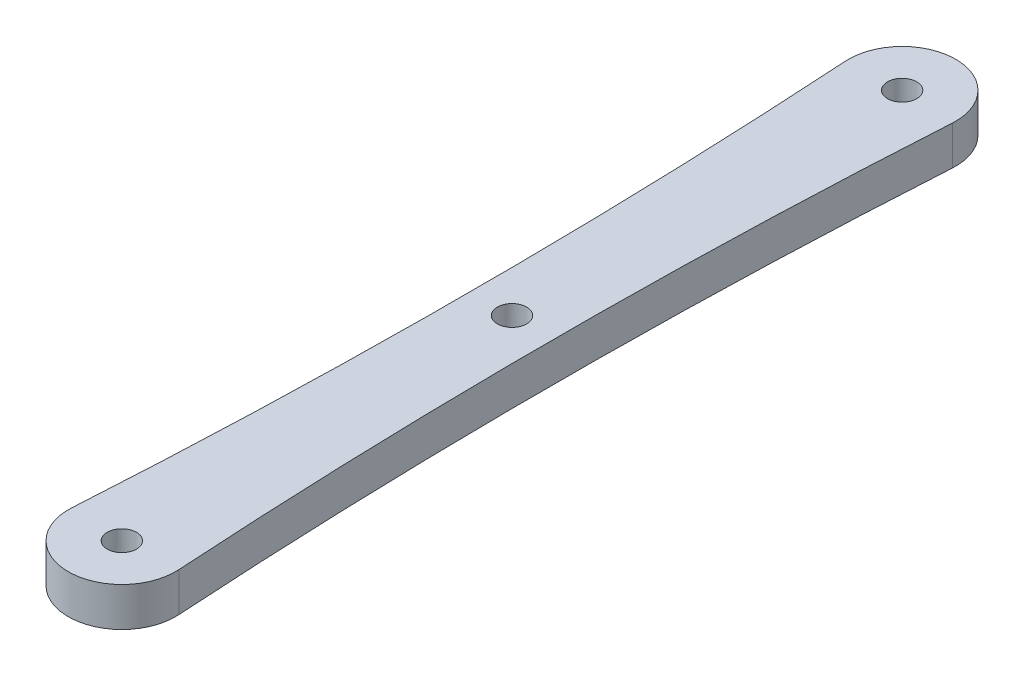
ISO-10303-21;
HEADER;
FILE_DESCRIPTION(('STEP AP214'),'2;1');
FILE_NAME('part.step','',(''),(''),'','','');
FILE_SCHEMA(('AUTOMOTIVE_DESIGN { 1 0 10303 214 1 1 1 1 }'));
ENDSEC;
DATA;
#1=APPLICATION_CONTEXT('core data for automotive mechanical design processes');
#2=APPLICATION_PROTOCOL_DEFINITION('international standard','automotive_design',2000,#1);
#3=PRODUCT_CONTEXT('',#1,'mechanical');
#4=PRODUCT('Part','Part','',(#3));
#5=PRODUCT_RELATED_PRODUCT_CATEGORY('part','',(#4));
#6=PRODUCT_DEFINITION_FORMATION('','',#4);
#7=PRODUCT_DEFINITION_CONTEXT('part definition',#1,'design');
#8=PRODUCT_DEFINITION('design','',#6,#7);
#9=PRODUCT_DEFINITION_SHAPE('','',#8);
#10=(LENGTH_UNIT() NAMED_UNIT(*) SI_UNIT(.MILLI.,.METRE.));
#11=(NAMED_UNIT(*) PLANE_ANGLE_UNIT() SI_UNIT($,.RADIAN.));
#12=(NAMED_UNIT(*) SI_UNIT($,.STERADIAN.) SOLID_ANGLE_UNIT());
#13=UNCERTAINTY_MEASURE_WITH_UNIT(LENGTH_MEASURE(1.E-05),#10,'distance_accuracy_value','');
#14=(GEOMETRIC_REPRESENTATION_CONTEXT(3) GLOBAL_UNCERTAINTY_ASSIGNED_CONTEXT((#13)) GLOBAL_UNIT_ASSIGNED_CONTEXT((#10,
#11,#12)) REPRESENTATION_CONTEXT('',''));
#15=CARTESIAN_POINT('',(0.,0.,0.));
#16=DIRECTION('',(0.,0.,1.));
#17=DIRECTION('',(1.,0.,0.));
#18=AXIS2_PLACEMENT_3D('',#15,#16,#17);
#19=CARTESIAN_POINT('',(-319.6875,4.,-19.9999999999999));
#20=DIRECTION('',(0.,-1.,0.));
#21=DIRECTION('',(0.,0.,-1.));
#22=AXIS2_PLACEMENT_3D('',#19,#20,#21);
#23=PLANE('',#22);
#24=CARTESIAN_POINT('',(-639.375,4.,-39.9999999999998));
#25=DIRECTION('',(0.,-1.,0.));
#26=DIRECTION('',(0.,0.,-1.));
#27=AXIS2_PLACEMENT_3D('',#24,#25,#26);
#28=CIRCLE('',#27,635.124999999999);
#29=CARTESIAN_POINT('',(-5.48926829268328,4.,-79.6565853658536));
#30=VERTEX_POINT('',#29);
#31=CARTESIAN_POINT('',(-5.48926829268329,4.,-0.343414634146373));
#32=VERTEX_POINT('',#31);
#33=EDGE_CURVE('E87',#30,#32,#28,.T.);
#34=ORIENTED_EDGE('',*,*,#33,.T.);
#35=CARTESIAN_POINT('',(0.,4.,0.));
#36=DIRECTION('',(0.,1.,0.));
#37=DIRECTION('',(0.,0.,1.));
#38=AXIS2_PLACEMENT_3D('',#35,#36,#37);
#39=CIRCLE('',#38,5.50000000000036);
#40=CARTESIAN_POINT('',(5.48926829268326,4.,-0.343414634146465));
#41=VERTEX_POINT('',#40);
#42=EDGE_CURVE('E82',#32,#41,#39,.T.);
#43=ORIENTED_EDGE('',*,*,#42,.T.);
#44=CARTESIAN_POINT('',(639.375,4.,-39.9999999999998));
#45=DIRECTION('',(0.,-1.,0.));
#46=DIRECTION('',(0.,0.,1.));
#47=AXIS2_PLACEMENT_3D('',#44,#45,#46);
#48=CIRCLE('',#47,635.124999999999);
#49=CARTESIAN_POINT('',(5.48926829268325,4.,-79.6565853658536));
#50=VERTEX_POINT('',#49);
#51=EDGE_CURVE('E85',#41,#50,#48,.T.);
#52=ORIENTED_EDGE('',*,*,#51,.T.);
#53=CARTESIAN_POINT('',(0.,4.,-80.));
#54=DIRECTION('',(0.,1.,0.));
#55=DIRECTION('',(0.,0.,1.));
#56=AXIS2_PLACEMENT_3D('',#53,#54,#55);
#57=CIRCLE('',#56,5.50000000000034);
#58=EDGE_CURVE('E52',#50,#30,#57,.T.);
#59=ORIENTED_EDGE('',*,*,#58,.T.);
#60=EDGE_LOOP('',(#34,#43,#52,#59));
#61=FACE_BOUND('',#60,.T.);
#62=CARTESIAN_POINT('',(0.,4.,-40.));
#63=DIRECTION('',(0.,1.,0.));
#64=DIRECTION('',(0.,0.,1.));
#65=AXIS2_PLACEMENT_3D('',#62,#63,#64);
#66=CIRCLE('',#65,1.5);
#67=CARTESIAN_POINT('',(0.,4.,-38.5));
#68=VERTEX_POINT('',#67);
#69=EDGE_CURVE('E102',#68,#68,#66,.T.);
#70=ORIENTED_EDGE('',*,*,#69,.F.);
#71=EDGE_LOOP('',(#70));
#72=FACE_BOUND('',#71,.T.);
#73=CARTESIAN_POINT('',(0.,4.,0.));
#74=DIRECTION('',(0.,1.,0.));
#75=DIRECTION('',(0.,0.,1.));
#76=AXIS2_PLACEMENT_3D('',#73,#74,#75);
#77=CIRCLE('',#76,1.5);
#78=CARTESIAN_POINT('',(0.,4.,1.5));
#79=VERTEX_POINT('',#78);
#80=EDGE_CURVE('E117',#79,#79,#77,.T.);
#81=ORIENTED_EDGE('',*,*,#80,.F.);
#82=EDGE_LOOP('',(#81));
#83=FACE_BOUND('',#82,.T.);
#84=CARTESIAN_POINT('',(0.,4.,-80.));
#85=DIRECTION('',(0.,1.,0.));
#86=DIRECTION('',(0.,0.,1.));
#87=AXIS2_PLACEMENT_3D('',#84,#85,#86);
#88=CIRCLE('',#87,1.5);
#89=CARTESIAN_POINT('',(0.,4.,-78.5));
#90=VERTEX_POINT('',#89);
#91=EDGE_CURVE('E123',#90,#90,#88,.T.);
#92=ORIENTED_EDGE('',*,*,#91,.F.);
#93=EDGE_LOOP('',(#92));
#94=FACE_BOUND('',#93,.T.);
#95=ADVANCED_FACE('F35',(#61,#72,#83,#94),#23,.F.);
#96=CARTESIAN_POINT('',(-319.6875,0.,-19.9999999999999));
#97=DIRECTION('',(0.,-1.,0.));
#98=DIRECTION('',(0.,0.,-1.));
#99=AXIS2_PLACEMENT_3D('',#96,#97,#98);
#100=PLANE('',#99);
#101=CARTESIAN_POINT('',(0.,0.,0.));
#102=DIRECTION('',(0.,1.,0.));
#103=DIRECTION('',(0.,0.,1.));
#104=AXIS2_PLACEMENT_3D('',#101,#102,#103);
#105=CIRCLE('',#104,1.5);
#106=CARTESIAN_POINT('',(0.,0.,1.5));
#107=VERTEX_POINT('',#106);
#108=EDGE_CURVE('E120',#107,#107,#105,.T.);
#109=ORIENTED_EDGE('',*,*,#108,.T.);
#110=EDGE_LOOP('',(#109));
#111=FACE_BOUND('',#110,.T.);
#112=CARTESIAN_POINT('',(-639.375,0.,-39.9999999999998));
#113=DIRECTION('',(0.,-1.,0.));
#114=DIRECTION('',(0.,0.,-1.));
#115=AXIS2_PLACEMENT_3D('',#112,#113,#114);
#116=CIRCLE('',#115,635.124999999999);
#117=CARTESIAN_POINT('',(-5.48926829268328,0.,-79.6565853658536));
#118=VERTEX_POINT('',#117);
#119=CARTESIAN_POINT('',(-5.48926829268329,0.,-0.343414634146373));
#120=VERTEX_POINT('',#119);
#121=EDGE_CURVE('E99',#118,#120,#116,.T.);
#122=ORIENTED_EDGE('',*,*,#121,.F.);
#123=CARTESIAN_POINT('',(0.,0.,-80.));
#124=DIRECTION('',(0.,1.,0.));
#125=DIRECTION('',(0.,0.,1.));
#126=AXIS2_PLACEMENT_3D('',#123,#124,#125);
#127=CIRCLE('',#126,5.50000000000034);
#128=CARTESIAN_POINT('',(5.48926829268325,0.,-79.6565853658536));
#129=VERTEX_POINT('',#128);
#130=EDGE_CURVE('E75',#129,#118,#127,.T.);
#131=ORIENTED_EDGE('',*,*,#130,.F.);
#132=CARTESIAN_POINT('',(639.375,0.,-39.9999999999998));
#133=DIRECTION('',(0.,-1.,0.));
#134=DIRECTION('',(0.,0.,1.));
#135=AXIS2_PLACEMENT_3D('',#132,#133,#134);
#136=CIRCLE('',#135,635.124999999999);
#137=CARTESIAN_POINT('',(5.48926829268326,0.,-0.343414634146465));
#138=VERTEX_POINT('',#137);
#139=EDGE_CURVE('E69',#138,#129,#136,.T.);
#140=ORIENTED_EDGE('',*,*,#139,.F.);
#141=CARTESIAN_POINT('',(0.,0.,0.));
#142=DIRECTION('',(0.,1.,0.));
#143=DIRECTION('',(0.,0.,1.));
#144=AXIS2_PLACEMENT_3D('',#141,#142,#143);
#145=CIRCLE('',#144,5.50000000000036);
#146=EDGE_CURVE('E91',#120,#138,#145,.T.);
#147=ORIENTED_EDGE('',*,*,#146,.F.);
#148=EDGE_LOOP('',(#122,#131,#140,#147));
#149=FACE_BOUND('',#148,.T.);
#150=CARTESIAN_POINT('',(0.,0.,-40.));
#151=DIRECTION('',(0.,1.,0.));
#152=DIRECTION('',(0.,0.,1.));
#153=AXIS2_PLACEMENT_3D('',#150,#151,#152);
#154=CIRCLE('',#153,1.5);
#155=CARTESIAN_POINT('',(0.,0.,-38.5));
#156=VERTEX_POINT('',#155);
#157=EDGE_CURVE('E114',#156,#156,#154,.T.);
#158=ORIENTED_EDGE('',*,*,#157,.T.);
#159=EDGE_LOOP('',(#158));
#160=FACE_BOUND('',#159,.T.);
#161=CARTESIAN_POINT('',(0.,0.,-80.));
#162=DIRECTION('',(0.,1.,0.));
#163=DIRECTION('',(0.,0.,1.));
#164=AXIS2_PLACEMENT_3D('',#161,#162,#163);
#165=CIRCLE('',#164,1.5);
#166=CARTESIAN_POINT('',(0.,0.,-78.5));
#167=VERTEX_POINT('',#166);
#168=EDGE_CURVE('E126',#167,#167,#165,.T.);
#169=ORIENTED_EDGE('',*,*,#168,.T.);
#170=EDGE_LOOP('',(#169));
#171=FACE_BOUND('',#170,.T.);
#172=ADVANCED_FACE('F110',(#111,#149,#160,#171),#100,.T.);
#173=CARTESIAN_POINT('',(-639.375,4.,-39.9999999999998));
#174=DIRECTION('',(0.,-1.,0.));
#175=DIRECTION('',(0.,0.,-1.));
#176=AXIS2_PLACEMENT_3D('',#173,#174,#175);
#177=CYLINDRICAL_SURFACE('',#176,635.124999999999);
#178=ORIENTED_EDGE('',*,*,#121,.T.);
#179=DIRECTION('',(0.,-1.,0.));
#180=VECTOR('',#179,1.);
#181=CARTESIAN_POINT('',(-5.48926829268329,4.,-0.343414634146373));
#182=LINE('',#181,#180);
#183=EDGE_CURVE('E11',#32,#120,#182,.T.);
#184=ORIENTED_EDGE('',*,*,#183,.F.);
#185=ORIENTED_EDGE('',*,*,#33,.F.);
#186=DIRECTION('',(0.,-1.,0.));
#187=VECTOR('',#186,1.);
#188=CARTESIAN_POINT('',(-5.48926829268328,4.,-79.6565853658536));
#189=LINE('',#188,#187);
#190=EDGE_CURVE('E95',#30,#118,#189,.T.);
#191=ORIENTED_EDGE('',*,*,#190,.T.);
#192=EDGE_LOOP('',(#178,#184,#185,#191));
#193=FACE_BOUND('',#192,.T.);
#194=ADVANCED_FACE('F37',(#193),#177,.F.);
#195=CARTESIAN_POINT('',(0.,4.,0.));
#196=DIRECTION('',(0.,-1.,0.));
#197=DIRECTION('',(0.,0.,-1.));
#198=AXIS2_PLACEMENT_3D('',#195,#196,#197);
#199=CYLINDRICAL_SURFACE('',#198,5.50000000000036);
#200=ORIENTED_EDGE('',*,*,#146,.T.);
#201=DIRECTION('',(0.,-1.,0.));
#202=VECTOR('',#201,1.);
#203=CARTESIAN_POINT('',(5.48926829268326,4.,-0.343414634146465));
#204=LINE('',#203,#202);
#205=EDGE_CURVE('E44',#41,#138,#204,.T.);
#206=ORIENTED_EDGE('',*,*,#205,.F.);
#207=ORIENTED_EDGE('',*,*,#42,.F.);
#208=ORIENTED_EDGE('',*,*,#183,.T.);
#209=EDGE_LOOP('',(#200,#206,#207,#208));
#210=FACE_BOUND('',#209,.T.);
#211=ADVANCED_FACE('F90',(#210),#199,.T.);
#212=CARTESIAN_POINT('',(639.375,4.,-39.9999999999998));
#213=DIRECTION('',(0.,-1.,0.));
#214=DIRECTION('',(0.,0.,-1.));
#215=AXIS2_PLACEMENT_3D('',#212,#213,#214);
#216=CYLINDRICAL_SURFACE('',#215,635.124999999999);
#217=ORIENTED_EDGE('',*,*,#139,.T.);
#218=DIRECTION('',(0.,-1.,0.));
#219=VECTOR('',#218,1.);
#220=CARTESIAN_POINT('',(5.48926829268325,4.,-79.6565853658536));
#221=LINE('',#220,#219);
#222=EDGE_CURVE('E92',#50,#129,#221,.T.);
#223=ORIENTED_EDGE('',*,*,#222,.F.);
#224=ORIENTED_EDGE('',*,*,#51,.F.);
#225=ORIENTED_EDGE('',*,*,#205,.T.);
#226=EDGE_LOOP('',(#217,#223,#224,#225));
#227=FACE_BOUND('',#226,.T.);
#228=ADVANCED_FACE('F93',(#227),#216,.F.);
#229=CARTESIAN_POINT('',(0.,4.,-80.));
#230=DIRECTION('',(0.,-1.,0.));
#231=DIRECTION('',(0.,0.,-1.));
#232=AXIS2_PLACEMENT_3D('',#229,#230,#231);
#233=CYLINDRICAL_SURFACE('',#232,5.50000000000034);
#234=ORIENTED_EDGE('',*,*,#130,.T.);
#235=ORIENTED_EDGE('',*,*,#190,.F.);
#236=ORIENTED_EDGE('',*,*,#58,.F.);
#237=ORIENTED_EDGE('',*,*,#222,.T.);
#238=EDGE_LOOP('',(#234,#235,#236,#237));
#239=FACE_BOUND('',#238,.T.);
#240=ADVANCED_FACE('F107',(#239),#233,.T.);
#241=CARTESIAN_POINT('',(0.,4.,-40.));
#242=DIRECTION('',(0.,-1.,0.));
#243=DIRECTION('',(0.,0.,-1.));
#244=AXIS2_PLACEMENT_3D('',#241,#242,#243);
#245=CYLINDRICAL_SURFACE('',#244,1.5);
#246=ORIENTED_EDGE('',*,*,#69,.T.);
#247=EDGE_LOOP('',(#246));
#248=FACE_BOUND('',#247,.T.);
#249=ORIENTED_EDGE('',*,*,#157,.F.);
#250=EDGE_LOOP('',(#249));
#251=FACE_BOUND('',#250,.T.);
#252=ADVANCED_FACE('F143',(#248,#251),#245,.F.);
#253=CARTESIAN_POINT('',(0.,4.,0.));
#254=DIRECTION('',(0.,-1.,0.));
#255=DIRECTION('',(0.,0.,-1.));
#256=AXIS2_PLACEMENT_3D('',#253,#254,#255);
#257=CYLINDRICAL_SURFACE('',#256,1.5);
#258=ORIENTED_EDGE('',*,*,#80,.T.);
#259=EDGE_LOOP('',(#258));
#260=FACE_BOUND('',#259,.T.);
#261=ORIENTED_EDGE('',*,*,#108,.F.);
#262=EDGE_LOOP('',(#261));
#263=FACE_BOUND('',#262,.T.);
#264=ADVANCED_FACE('F189',(#260,#263),#257,.F.);
#265=CARTESIAN_POINT('',(0.,4.,-80.));
#266=DIRECTION('',(0.,-1.,0.));
#267=DIRECTION('',(0.,0.,-1.));
#268=AXIS2_PLACEMENT_3D('',#265,#266,#267);
#269=CYLINDRICAL_SURFACE('',#268,1.5);
#270=ORIENTED_EDGE('',*,*,#91,.T.);
#271=EDGE_LOOP('',(#270));
#272=FACE_BOUND('',#271,.T.);
#273=ORIENTED_EDGE('',*,*,#168,.F.);
#274=EDGE_LOOP('',(#273));
#275=FACE_BOUND('',#274,.T.);
#276=ADVANCED_FACE('F132',(#272,#275),#269,.F.);
#277=CLOSED_SHELL('',(#95,#172,#194,#211,#228,#240,#252,#264,#276));
#278=MANIFOLD_SOLID_BREP('B2',#277);
#279=ADVANCED_BREP_SHAPE_REPRESENTATION('',(#18,#278),#14);
#280=SHAPE_DEFINITION_REPRESENTATION(#9,#279);
ENDSEC;
END-ISO-10303-21;
